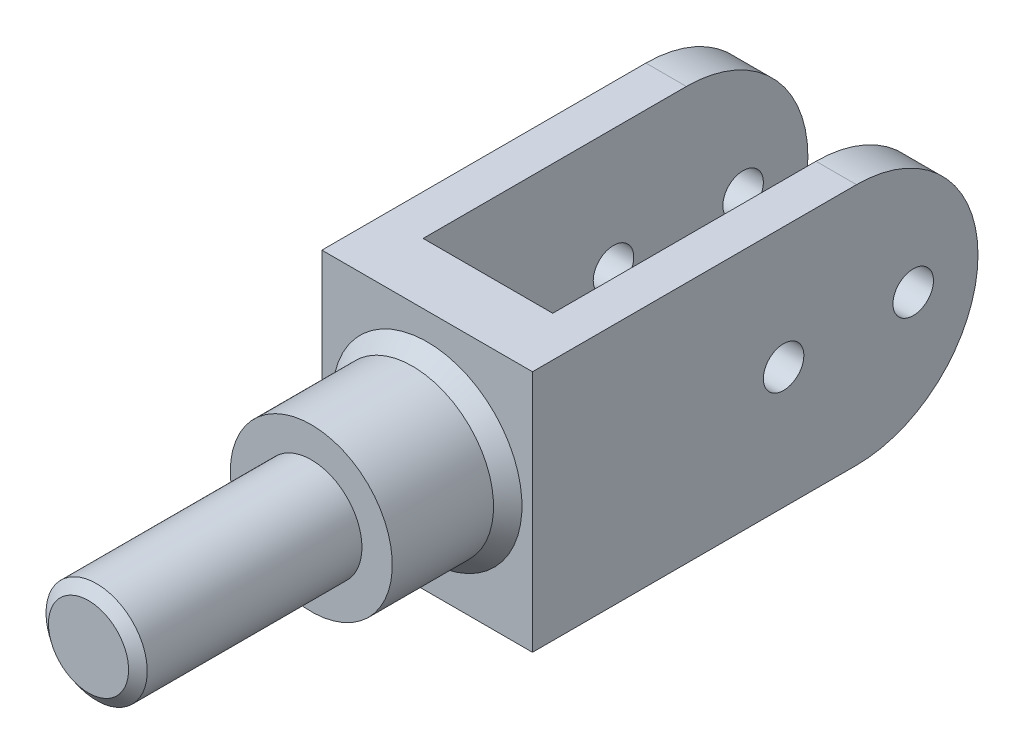
ISO-10303-21;
HEADER;
FILE_DESCRIPTION(('STEP AP214'),'2;1');
FILE_NAME('part.step','',(''),(''),'','','');
FILE_SCHEMA(('AUTOMOTIVE_DESIGN { 1 0 10303 214 1 1 1 1 }'));
ENDSEC;
DATA;
#1=APPLICATION_CONTEXT('core data for automotive mechanical design processes');
#2=APPLICATION_PROTOCOL_DEFINITION('international standard','automotive_design',2000,#1);
#3=PRODUCT_CONTEXT('',#1,'mechanical');
#4=PRODUCT('Part','Part','',(#3));
#5=PRODUCT_RELATED_PRODUCT_CATEGORY('part','',(#4));
#6=PRODUCT_DEFINITION_FORMATION('','',#4);
#7=PRODUCT_DEFINITION_CONTEXT('part definition',#1,'design');
#8=PRODUCT_DEFINITION('design','',#6,#7);
#9=PRODUCT_DEFINITION_SHAPE('','',#8);
#10=(LENGTH_UNIT() NAMED_UNIT(*) SI_UNIT(.MILLI.,.METRE.));
#11=(NAMED_UNIT(*) PLANE_ANGLE_UNIT() SI_UNIT($,.RADIAN.));
#12=(NAMED_UNIT(*) SI_UNIT($,.STERADIAN.) SOLID_ANGLE_UNIT());
#13=UNCERTAINTY_MEASURE_WITH_UNIT(LENGTH_MEASURE(1.E-05),#10,'distance_accuracy_value','');
#14=(GEOMETRIC_REPRESENTATION_CONTEXT(3) GLOBAL_UNCERTAINTY_ASSIGNED_CONTEXT((#13)) GLOBAL_UNIT_ASSIGNED_CONTEXT((#10,
#11,#12)) REPRESENTATION_CONTEXT('',''));
#15=CARTESIAN_POINT('',(0.,0.,0.));
#16=DIRECTION('',(0.,0.,1.));
#17=DIRECTION('',(1.,0.,0.));
#18=AXIS2_PLACEMENT_3D('',#15,#16,#17);
#19=CARTESIAN_POINT('',(-25.9987772316639,-37.678152538923,-19.9658536129877));
#20=DIRECTION('',(-1.,0.,0.));
#21=DIRECTION('',(0.,0.,1.));
#22=AXIS2_PLACEMENT_3D('',#19,#20,#21);
#23=PLANE('',#22);
#24=CARTESIAN_POINT('',(-25.9987772316639,-7.67815253892304,-76.9658536129877));
#25=DIRECTION('',(-1.,0.,0.));
#26=DIRECTION('',(0.,0.,1.));
#27=AXIS2_PLACEMENT_3D('',#24,#25,#26);
#28=CIRCLE('',#27,5.);
#29=CARTESIAN_POINT('',(-25.9987772316639,-7.67815253892304,-71.9658536129877));
#30=VERTEX_POINT('',#29);
#31=EDGE_CURVE('E227',#30,#30,#28,.F.);
#32=ORIENTED_EDGE('',*,*,#31,.T.);
#33=EDGE_LOOP('',(#32));
#34=FACE_BOUND('',#33,.T.);
#35=CARTESIAN_POINT('',(-25.9987772316639,-7.67815253892303,-108.965853612988));
#36=DIRECTION('',(-1.,0.,0.));
#37=DIRECTION('',(0.,0.,1.));
#38=AXIS2_PLACEMENT_3D('',#35,#36,#37);
#39=CIRCLE('',#38,5.);
#40=CARTESIAN_POINT('',(-25.9987772316639,-7.67815253892303,-103.965853612988));
#41=VERTEX_POINT('',#40);
#42=EDGE_CURVE('E210',#41,#41,#39,.F.);
#43=ORIENTED_EDGE('',*,*,#42,.T.);
#44=EDGE_LOOP('',(#43));
#45=FACE_BOUND('',#44,.T.);
#46=CARTESIAN_POINT('',(-25.9987772316639,-7.67815253892303,-94.9658536129877));
#47=DIRECTION('',(-1.,0.,0.));
#48=DIRECTION('',(0.,0.,1.));
#49=AXIS2_PLACEMENT_3D('',#46,#47,#48);
#50=CIRCLE('',#49,30.);
#51=CARTESIAN_POINT('',(-25.9987772316639,-37.678152538923,-94.9658536129877));
#52=VERTEX_POINT('',#51);
#53=CARTESIAN_POINT('',(-25.9987772316639,22.321847461077,-94.9658536129877));
#54=VERTEX_POINT('',#53);
#55=EDGE_CURVE('E148',#52,#54,#50,.F.);
#56=ORIENTED_EDGE('',*,*,#55,.F.);
#57=DIRECTION('',(0.,0.,-1.));
#58=VECTOR('',#57,1.);
#59=CARTESIAN_POINT('',(-25.9987772316639,-37.678152538923,-19.9658536129877));
#60=LINE('',#59,#58);
#61=CARTESIAN_POINT('',(-25.9987772316639,-37.678152538923,-14.9658536129877));
#62=VERTEX_POINT('',#61);
#63=EDGE_CURVE('E165',#62,#52,#60,.T.);
#64=ORIENTED_EDGE('',*,*,#63,.F.);
#65=DIRECTION('',(0.,1.,0.));
#66=VECTOR('',#65,1.);
#67=CARTESIAN_POINT('',(-25.9987772316639,-37.678152538923,-14.9658536129877));
#68=LINE('',#67,#66);
#69=CARTESIAN_POINT('',(-25.9987772316639,22.321847461077,-14.9658536129877));
#70=VERTEX_POINT('',#69);
#71=EDGE_CURVE('E244',#62,#70,#68,.T.);
#72=ORIENTED_EDGE('',*,*,#71,.T.);
#73=DIRECTION('',(0.,0.,-1.));
#74=VECTOR('',#73,1.);
#75=CARTESIAN_POINT('',(-25.9987772316639,22.321847461077,-19.9658536129877));
#76=LINE('',#75,#74);
#77=EDGE_CURVE('E180',#70,#54,#76,.T.);
#78=ORIENTED_EDGE('',*,*,#77,.T.);
#79=EDGE_LOOP('',(#56,#64,#72,#78));
#80=FACE_BOUND('',#79,.T.);
#81=ADVANCED_FACE('F73',(#34,#45,#80),#23,.T.);
#82=CARTESIAN_POINT('',(26.0012227683361,-37.678152538923,-19.9658536129877));
#83=DIRECTION('',(0.,-1.,0.));
#84=DIRECTION('',(1.,0.,0.));
#85=AXIS2_PLACEMENT_3D('',#82,#83,#84);
#86=PLANE('',#85);
#87=ORIENTED_EDGE('',*,*,#63,.T.);
#88=DIRECTION('',(1.,0.,0.));
#89=VECTOR('',#88,1.);
#90=CARTESIAN_POINT('',(-207.998777231664,-37.678152538923,-94.9658536129877));
#91=LINE('',#90,#89);
#92=CARTESIAN_POINT('',(-15.9987772316639,-37.678152538923,-94.9658536129877));
#93=VERTEX_POINT('',#92);
#94=EDGE_CURVE('E158',#52,#93,#91,.T.);
#95=ORIENTED_EDGE('',*,*,#94,.T.);
#96=DIRECTION('',(0.,0.,-1.));
#97=VECTOR('',#96,1.);
#98=CARTESIAN_POINT('',(-15.9987772316639,-37.678152538923,-19.9658536129877));
#99=LINE('',#98,#97);
#100=CARTESIAN_POINT('',(-15.9987772316639,-37.678152538923,-29.9658536129877));
#101=VERTEX_POINT('',#100);
#102=EDGE_CURVE('E198',#101,#93,#99,.T.);
#103=ORIENTED_EDGE('',*,*,#102,.F.);
#104=DIRECTION('',(-1.,0.,0.));
#105=VECTOR('',#104,1.);
#106=CARTESIAN_POINT('',(26.0012227683361,-37.678152538923,-29.9658536129877));
#107=LINE('',#106,#105);
#108=CARTESIAN_POINT('',(16.0012227683361,-37.678152538923,-29.9658536129877));
#109=VERTEX_POINT('',#108);
#110=EDGE_CURVE('E201',#109,#101,#107,.T.);
#111=ORIENTED_EDGE('',*,*,#110,.F.);
#112=DIRECTION('',(0.,0.,1.));
#113=VECTOR('',#112,1.);
#114=CARTESIAN_POINT('',(16.0012227683361,-37.678152538923,-19.9658536129877));
#115=LINE('',#114,#113);
#116=CARTESIAN_POINT('',(16.0012227683361,-37.678152538923,-94.9658536129877));
#117=VERTEX_POINT('',#116);
#118=EDGE_CURVE('E81',#117,#109,#115,.T.);
#119=ORIENTED_EDGE('',*,*,#118,.F.);
#120=CARTESIAN_POINT('',(26.0012227683361,-37.678152538923,-94.9658536129877));
#121=VERTEX_POINT('',#120);
#122=EDGE_CURVE('E141',#117,#121,#91,.T.);
#123=ORIENTED_EDGE('',*,*,#122,.T.);
#124=DIRECTION('',(0.,0.,-1.));
#125=VECTOR('',#124,1.);
#126=CARTESIAN_POINT('',(26.0012227683361,-37.678152538923,-19.9658536129877));
#127=LINE('',#126,#125);
#128=CARTESIAN_POINT('',(26.0012227683361,-37.678152538923,-14.9658536129877));
#129=VERTEX_POINT('',#128);
#130=EDGE_CURVE('E155',#129,#121,#127,.T.);
#131=ORIENTED_EDGE('',*,*,#130,.F.);
#132=DIRECTION('',(-1.,0.,0.));
#133=VECTOR('',#132,1.);
#134=CARTESIAN_POINT('',(26.0012227683361,-37.678152538923,-14.9658536129877));
#135=LINE('',#134,#133);
#136=EDGE_CURVE('E248',#129,#62,#135,.T.);
#137=ORIENTED_EDGE('',*,*,#136,.T.);
#138=EDGE_LOOP('',(#87,#95,#103,#111,#119,#123,#131,#137));
#139=FACE_BOUND('',#138,.T.);
#140=ADVANCED_FACE('F153',(#139),#86,.T.);
#141=CARTESIAN_POINT('',(26.0012227683361,22.321847461077,-19.9658536129877));
#142=DIRECTION('',(1.,0.,0.));
#143=DIRECTION('',(0.,0.,-1.));
#144=AXIS2_PLACEMENT_3D('',#141,#142,#143);
#145=PLANE('',#144);
#146=CARTESIAN_POINT('',(26.0012227683361,-7.67815253892304,-76.9658536129877));
#147=DIRECTION('',(1.,0.,0.));
#148=DIRECTION('',(0.,0.,-1.));
#149=AXIS2_PLACEMENT_3D('',#146,#147,#148);
#150=CIRCLE('',#149,5.);
#151=CARTESIAN_POINT('',(26.0012227683361,-7.67815253892304,-81.9658536129877));
#152=VERTEX_POINT('',#151);
#153=EDGE_CURVE('E214',#152,#152,#150,.F.);
#154=ORIENTED_EDGE('',*,*,#153,.T.);
#155=EDGE_LOOP('',(#154));
#156=FACE_BOUND('',#155,.T.);
#157=CARTESIAN_POINT('',(26.0012227683361,-7.67815253892303,-108.965853612988));
#158=DIRECTION('',(1.,0.,0.));
#159=DIRECTION('',(0.,0.,-1.));
#160=AXIS2_PLACEMENT_3D('',#157,#158,#159);
#161=CIRCLE('',#160,5.);
#162=CARTESIAN_POINT('',(26.0012227683361,-7.67815253892303,-113.965853612988));
#163=VERTEX_POINT('',#162);
#164=EDGE_CURVE('E217',#163,#163,#161,.F.);
#165=ORIENTED_EDGE('',*,*,#164,.T.);
#166=EDGE_LOOP('',(#165));
#167=FACE_BOUND('',#166,.T.);
#168=ORIENTED_EDGE('',*,*,#130,.T.);
#169=CARTESIAN_POINT('',(26.0012227683361,-7.67815253892303,-94.9658536129877));
#170=DIRECTION('',(1.,0.,0.));
#171=DIRECTION('',(0.,0.,-1.));
#172=AXIS2_PLACEMENT_3D('',#169,#170,#171);
#173=CIRCLE('',#172,30.);
#174=CARTESIAN_POINT('',(26.0012227683361,22.321847461077,-94.9658536129877));
#175=VERTEX_POINT('',#174);
#176=EDGE_CURVE('E138',#175,#121,#173,.F.);
#177=ORIENTED_EDGE('',*,*,#176,.F.);
#178=DIRECTION('',(0.,0.,-1.));
#179=VECTOR('',#178,1.);
#180=CARTESIAN_POINT('',(26.0012227683361,22.321847461077,-19.9658536129877));
#181=LINE('',#180,#179);
#182=CARTESIAN_POINT('',(26.0012227683361,22.321847461077,-14.9658536129877));
#183=VERTEX_POINT('',#182);
#184=EDGE_CURVE('E170',#183,#175,#181,.T.);
#185=ORIENTED_EDGE('',*,*,#184,.F.);
#186=DIRECTION('',(0.,-1.,0.));
#187=VECTOR('',#186,1.);
#188=CARTESIAN_POINT('',(26.0012227683361,22.321847461077,-14.9658536129877));
#189=LINE('',#188,#187);
#190=EDGE_CURVE('E162',#183,#129,#189,.T.);
#191=ORIENTED_EDGE('',*,*,#190,.T.);
#192=EDGE_LOOP('',(#168,#177,#185,#191));
#193=FACE_BOUND('',#192,.T.);
#194=ADVANCED_FACE('F160',(#156,#167,#193),#145,.T.);
#195=CARTESIAN_POINT('',(16.0012227683361,-77.678152538923,-29.9658536129877));
#196=DIRECTION('',(1.,0.,0.));
#197=DIRECTION('',(0.,1.,0.));
#198=AXIS2_PLACEMENT_3D('',#195,#196,#197);
#199=PLANE('',#198);
#200=CARTESIAN_POINT('',(16.0012227683361,-7.67815253892303,-108.965853612988));
#201=DIRECTION('',(1.,0.,0.));
#202=DIRECTION('',(0.,1.,0.));
#203=AXIS2_PLACEMENT_3D('',#200,#201,#202);
#204=CIRCLE('',#203,5.);
#205=CARTESIAN_POINT('',(16.0012227683361,-2.67815253892303,-108.965853612988));
#206=VERTEX_POINT('',#205);
#207=EDGE_CURVE('E206',#206,#206,#204,.F.);
#208=ORIENTED_EDGE('',*,*,#207,.F.);
#209=EDGE_LOOP('',(#208));
#210=FACE_BOUND('',#209,.T.);
#211=CARTESIAN_POINT('',(16.0012227683361,-7.67815253892304,-76.9658536129877));
#212=DIRECTION('',(1.,0.,0.));
#213=DIRECTION('',(0.,1.,0.));
#214=AXIS2_PLACEMENT_3D('',#211,#212,#213);
#215=CIRCLE('',#214,5.);
#216=CARTESIAN_POINT('',(16.0012227683361,-2.67815253892303,-76.9658536129877));
#217=VERTEX_POINT('',#216);
#218=EDGE_CURVE('E209',#217,#217,#215,.F.);
#219=ORIENTED_EDGE('',*,*,#218,.F.);
#220=EDGE_LOOP('',(#219));
#221=FACE_BOUND('',#220,.T.);
#222=CARTESIAN_POINT('',(16.0012227683361,-7.67815253892303,-94.9658536129877));
#223=DIRECTION('',(1.,0.,0.));
#224=DIRECTION('',(0.,1.,0.));
#225=AXIS2_PLACEMENT_3D('',#222,#223,#224);
#226=CIRCLE('',#225,30.);
#227=CARTESIAN_POINT('',(16.0012227683361,22.321847461077,-94.9658536129877));
#228=VERTEX_POINT('',#227);
#229=EDGE_CURVE('E149',#228,#117,#226,.F.);
#230=ORIENTED_EDGE('',*,*,#229,.T.);
#231=ORIENTED_EDGE('',*,*,#118,.T.);
#232=DIRECTION('',(0.,1.,0.));
#233=VECTOR('',#232,1.);
#234=CARTESIAN_POINT('',(16.0012227683361,-77.678152538923,-29.9658536129877));
#235=LINE('',#234,#233);
#236=CARTESIAN_POINT('',(16.0012227683361,22.321847461077,-29.9658536129877));
#237=VERTEX_POINT('',#236);
#238=EDGE_CURVE('E238',#109,#237,#235,.T.);
#239=ORIENTED_EDGE('',*,*,#238,.T.);
#240=DIRECTION('',(0.,0.,-1.));
#241=VECTOR('',#240,1.);
#242=CARTESIAN_POINT('',(16.0012227683361,22.321847461077,-29.9658536129877));
#243=LINE('',#242,#241);
#244=EDGE_CURVE('E235',#237,#228,#243,.T.);
#245=ORIENTED_EDGE('',*,*,#244,.T.);
#246=EDGE_LOOP('',(#230,#231,#239,#245));
#247=FACE_BOUND('',#246,.T.);
#248=ADVANCED_FACE('F277',(#210,#221,#247),#199,.F.);
#249=CARTESIAN_POINT('',(-15.9987772316639,-77.678152538923,-124.965853612988));
#250=DIRECTION('',(-1.,0.,0.));
#251=DIRECTION('',(0.,0.,1.));
#252=AXIS2_PLACEMENT_3D('',#249,#250,#251);
#253=PLANE('',#252);
#254=CARTESIAN_POINT('',(-15.9987772316639,-7.67815253892303,-108.965853612988));
#255=DIRECTION('',(-1.,0.,0.));
#256=DIRECTION('',(0.,0.,1.));
#257=AXIS2_PLACEMENT_3D('',#254,#255,#256);
#258=CIRCLE('',#257,5.);
#259=CARTESIAN_POINT('',(-15.9987772316639,-7.67815253892303,-103.965853612988));
#260=VERTEX_POINT('',#259);
#261=EDGE_CURVE('E204',#260,#260,#258,.F.);
#262=ORIENTED_EDGE('',*,*,#261,.F.);
#263=EDGE_LOOP('',(#262));
#264=FACE_BOUND('',#263,.T.);
#265=CARTESIAN_POINT('',(-15.9987772316639,-7.67815253892304,-76.9658536129877));
#266=DIRECTION('',(-1.,0.,0.));
#267=DIRECTION('',(0.,0.,1.));
#268=AXIS2_PLACEMENT_3D('',#265,#266,#267);
#269=CIRCLE('',#268,5.);
#270=CARTESIAN_POINT('',(-15.9987772316639,-7.67815253892304,-71.9658536129877));
#271=VERTEX_POINT('',#270);
#272=EDGE_CURVE('E207',#271,#271,#269,.F.);
#273=ORIENTED_EDGE('',*,*,#272,.F.);
#274=EDGE_LOOP('',(#273));
#275=FACE_BOUND('',#274,.T.);
#276=ORIENTED_EDGE('',*,*,#102,.T.);
#277=CARTESIAN_POINT('',(-15.9987772316639,-7.67815253892303,-94.9658536129877));
#278=DIRECTION('',(-1.,0.,0.));
#279=DIRECTION('',(0.,0.,1.));
#280=AXIS2_PLACEMENT_3D('',#277,#278,#279);
#281=CIRCLE('',#280,30.);
#282=CARTESIAN_POINT('',(-15.9987772316639,22.321847461077,-94.9658536129877));
#283=VERTEX_POINT('',#282);
#284=EDGE_CURVE('E13',#93,#283,#281,.F.);
#285=ORIENTED_EDGE('',*,*,#284,.T.);
#286=DIRECTION('',(0.,0.,1.));
#287=VECTOR('',#286,1.);
#288=CARTESIAN_POINT('',(-15.9987772316639,22.321847461077,-124.965853612988));
#289=LINE('',#288,#287);
#290=CARTESIAN_POINT('',(-15.9987772316639,22.321847461077,-29.9658536129877));
#291=VERTEX_POINT('',#290);
#292=EDGE_CURVE('E230',#283,#291,#289,.T.);
#293=ORIENTED_EDGE('',*,*,#292,.T.);
#294=DIRECTION('',(0.,1.,0.));
#295=VECTOR('',#294,1.);
#296=CARTESIAN_POINT('',(-15.9987772316639,-77.678152538923,-29.9658536129877));
#297=LINE('',#296,#295);
#298=EDGE_CURVE('E95',#101,#291,#297,.T.);
#299=ORIENTED_EDGE('',*,*,#298,.F.);
#300=EDGE_LOOP('',(#276,#285,#293,#299));
#301=FACE_BOUND('',#300,.T.);
#302=ADVANCED_FACE('F280',(#264,#275,#301),#253,.F.);
#303=CARTESIAN_POINT('',(0.,-7.68609771448305,-15.0549543530274));
#304=DIRECTION('',(0.,0.,-1.));
#305=DIRECTION('',(-1.,0.,0.));
#306=AXIS2_PLACEMENT_3D('',#303,#304,#305);
#307=CONICAL_SURFACE('',#306,23.4929032291363,0.756614295865434);
#308=CARTESIAN_POINT('',(0.,-7.68609771448305,-11.3549543530274));
#309=DIRECTION('',(0.,0.,-1.));
#310=DIRECTION('',(-1.,0.,0.));
#311=AXIS2_PLACEMENT_3D('',#308,#309,#310);
#312=CIRCLE('',#311,20.);
#313=CARTESIAN_POINT('',(-20.,-7.68609771448305,-11.3549543530274));
#314=VERTEX_POINT('',#313);
#315=EDGE_CURVE('E168',#314,#314,#312,.T.);
#316=ORIENTED_EDGE('',*,*,#315,.T.);
#317=EDGE_LOOP('',(#316));
#318=FACE_BOUND('',#317,.T.);
#319=CARTESIAN_POINT('',(0.,-7.68609771448305,-14.9658536129878));
#320=DIRECTION('',(0.,0.,-1.));
#321=DIRECTION('',(-1.,0.,0.));
#322=AXIS2_PLACEMENT_3D('',#319,#320,#321);
#323=CIRCLE('',#322,23.408789644649);
#324=CARTESIAN_POINT('',(-23.408789644649,-7.68609771448305,-14.9658536129878));
#325=VERTEX_POINT('',#324);
#326=EDGE_CURVE('E164',#325,#325,#323,.F.);
#327=ORIENTED_EDGE('',*,*,#326,.T.);
#328=EDGE_LOOP('',(#327));
#329=FACE_BOUND('',#328,.T.);
#330=ADVANCED_FACE('F290',(#318,#329),#307,.T.);
#331=CARTESIAN_POINT('',(0.,-7.68609771448305,68.6450456469726));
#332=DIRECTION('',(0.,0.,1.));
#333=DIRECTION('',(1.,0.,0.));
#334=AXIS2_PLACEMENT_3D('',#331,#332,#333);
#335=PLANE('',#334);
#336=CARTESIAN_POINT('',(0.,-7.68609771448305,68.6450456469726));
#337=DIRECTION('',(0.,0.,-1.));
#338=DIRECTION('',(-1.,0.,0.));
#339=AXIS2_PLACEMENT_3D('',#336,#337,#338);
#340=CIRCLE('',#339,9.88910074003972);
#341=CARTESIAN_POINT('',(-9.88910074003972,-7.68609771448305,68.6450456469726));
#342=VERTEX_POINT('',#341);
#343=EDGE_CURVE('E196',#342,#342,#340,.T.);
#344=ORIENTED_EDGE('',*,*,#343,.F.);
#345=EDGE_LOOP('',(#344));
#346=FACE_BOUND('',#345,.T.);
#347=ADVANCED_FACE('F75',(#346),#335,.T.);
#348=CARTESIAN_POINT('',(0.,-7.68609771448305,66.6450456469726));
#349=DIRECTION('',(0.,0.,-1.));
#350=DIRECTION('',(-1.,0.,0.));
#351=AXIS2_PLACEMENT_3D('',#348,#349,#350);
#352=CONICAL_SURFACE('',#351,12.5,0.917121261097702);
#353=ORIENTED_EDGE('',*,*,#343,.T.);
#354=EDGE_LOOP('',(#353));
#355=FACE_BOUND('',#354,.T.);
#356=CARTESIAN_POINT('',(0.,-7.68609771448305,66.6450456469726));
#357=DIRECTION('',(0.,0.,-1.));
#358=DIRECTION('',(-1.,0.,0.));
#359=AXIS2_PLACEMENT_3D('',#356,#357,#358);
#360=CIRCLE('',#359,12.5);
#361=CARTESIAN_POINT('',(-12.5,-7.68609771448305,66.6450456469726));
#362=VERTEX_POINT('',#361);
#363=EDGE_CURVE('E193',#362,#362,#360,.T.);
#364=ORIENTED_EDGE('',*,*,#363,.F.);
#365=EDGE_LOOP('',(#364));
#366=FACE_BOUND('',#365,.T.);
#367=ADVANCED_FACE('F324',(#355,#366),#352,.T.);
#368=CARTESIAN_POINT('',(0.,-7.68609771448305,-15.0549543530274));
#369=DIRECTION('',(0.,0.,-1.));
#370=DIRECTION('',(-1.,0.,0.));
#371=AXIS2_PLACEMENT_3D('',#368,#369,#370);
#372=CYLINDRICAL_SURFACE('',#371,12.5);
#373=ORIENTED_EDGE('',*,*,#363,.T.);
#374=EDGE_LOOP('',(#373));
#375=FACE_BOUND('',#374,.T.);
#376=CARTESIAN_POINT('',(0.,-7.68609771448305,13.6450456469726));
#377=DIRECTION('',(0.,0.,-1.));
#378=DIRECTION('',(-1.,0.,0.));
#379=AXIS2_PLACEMENT_3D('',#376,#377,#378);
#380=CIRCLE('',#379,12.5);
#381=CARTESIAN_POINT('',(-12.5,-7.68609771448305,13.6450456469726));
#382=VERTEX_POINT('',#381);
#383=EDGE_CURVE('E190',#382,#382,#380,.T.);
#384=ORIENTED_EDGE('',*,*,#383,.F.);
#385=EDGE_LOOP('',(#384));
#386=FACE_BOUND('',#385,.T.);
#387=ADVANCED_FACE('F321',(#375,#386),#372,.T.);
#388=CARTESIAN_POINT('',(0.,4.81390228551694,13.6450456469726));
#389=DIRECTION('',(0.,0.,1.));
#390=DIRECTION('',(1.,0.,0.));
#391=AXIS2_PLACEMENT_3D('',#388,#389,#390);
#392=PLANE('',#391);
#393=ORIENTED_EDGE('',*,*,#383,.T.);
#394=EDGE_LOOP('',(#393));
#395=FACE_BOUND('',#394,.T.);
#396=CARTESIAN_POINT('',(0.,-7.68609771448305,13.6450456469726));
#397=DIRECTION('',(0.,0.,-1.));
#398=DIRECTION('',(-1.,0.,0.));
#399=AXIS2_PLACEMENT_3D('',#396,#397,#398);
#400=CIRCLE('',#399,20.);
#401=CARTESIAN_POINT('',(-20.,-7.68609771448305,13.6450456469726));
#402=VERTEX_POINT('',#401);
#403=EDGE_CURVE('E187',#402,#402,#400,.T.);
#404=ORIENTED_EDGE('',*,*,#403,.F.);
#405=EDGE_LOOP('',(#404));
#406=FACE_BOUND('',#405,.T.);
#407=ADVANCED_FACE('F317',(#395,#406),#392,.T.);
#408=CARTESIAN_POINT('',(0.,-7.68609771448305,-15.0549543530274));
#409=DIRECTION('',(0.,0.,-1.));
#410=DIRECTION('',(-1.,0.,0.));
#411=AXIS2_PLACEMENT_3D('',#408,#409,#410);
#412=CYLINDRICAL_SURFACE('',#411,20.);
#413=ORIENTED_EDGE('',*,*,#403,.T.);
#414=EDGE_LOOP('',(#413));
#415=FACE_BOUND('',#414,.T.);
#416=ORIENTED_EDGE('',*,*,#315,.F.);
#417=EDGE_LOOP('',(#416));
#418=FACE_BOUND('',#417,.T.);
#419=ADVANCED_FACE('F314',(#415,#418),#412,.T.);
#420=CARTESIAN_POINT('',(26.0012227683361,22.321847461077,-19.9658536129877));
#421=DIRECTION('',(0.,1.,0.));
#422=DIRECTION('',(-1.,0.,0.));
#423=AXIS2_PLACEMENT_3D('',#420,#421,#422);
#424=PLANE('',#423);
#425=DIRECTION('',(-1.,0.,0.));
#426=VECTOR('',#425,1.);
#427=CARTESIAN_POINT('',(260.001222768336,22.321847461077,-94.9658536129877));
#428=LINE('',#427,#426);
#429=EDGE_CURVE('E88',#283,#54,#428,.T.);
#430=ORIENTED_EDGE('',*,*,#429,.T.);
#431=ORIENTED_EDGE('',*,*,#77,.F.);
#432=DIRECTION('',(1.,0.,0.));
#433=VECTOR('',#432,1.);
#434=CARTESIAN_POINT('',(26.0012227683361,22.321847461077,-14.9658536129877));
#435=LINE('',#434,#433);
#436=EDGE_CURVE('E240',#70,#183,#435,.T.);
#437=ORIENTED_EDGE('',*,*,#436,.T.);
#438=ORIENTED_EDGE('',*,*,#184,.T.);
#439=EDGE_CURVE('E144',#175,#228,#428,.T.);
#440=ORIENTED_EDGE('',*,*,#439,.T.);
#441=ORIENTED_EDGE('',*,*,#244,.F.);
#442=DIRECTION('',(1.,0.,0.));
#443=VECTOR('',#442,1.);
#444=CARTESIAN_POINT('',(-15.9987772316639,22.321847461077,-29.9658536129877));
#445=LINE('',#444,#443);
#446=EDGE_CURVE('E232',#291,#237,#445,.T.);
#447=ORIENTED_EDGE('',*,*,#446,.F.);
#448=ORIENTED_EDGE('',*,*,#292,.F.);
#449=EDGE_LOOP('',(#430,#431,#437,#438,#440,#441,#447,#448));
#450=FACE_BOUND('',#449,.T.);
#451=ADVANCED_FACE('F258',(#450),#424,.T.);
#452=CARTESIAN_POINT('',(0.,0.,-14.9658536129878));
#453=DIRECTION('',(0.,0.,-1.));
#454=DIRECTION('',(-1.,0.,0.));
#455=AXIS2_PLACEMENT_3D('',#452,#453,#454);
#456=PLANE('',#455);
#457=ORIENTED_EDGE('',*,*,#326,.F.);
#458=EDGE_LOOP('',(#457));
#459=FACE_BOUND('',#458,.T.);
#460=ORIENTED_EDGE('',*,*,#436,.F.);
#461=ORIENTED_EDGE('',*,*,#71,.F.);
#462=ORIENTED_EDGE('',*,*,#136,.F.);
#463=ORIENTED_EDGE('',*,*,#190,.F.);
#464=EDGE_LOOP('',(#460,#461,#462,#463));
#465=FACE_BOUND('',#464,.T.);
#466=ADVANCED_FACE('F263',(#459,#465),#456,.F.);
#467=CARTESIAN_POINT('',(-15.9987772316639,-77.678152538923,-29.9658536129877));
#468=DIRECTION('',(0.,0.,1.));
#469=DIRECTION('',(1.,0.,0.));
#470=AXIS2_PLACEMENT_3D('',#467,#468,#469);
#471=PLANE('',#470);
#472=ORIENTED_EDGE('',*,*,#110,.T.);
#473=ORIENTED_EDGE('',*,*,#298,.T.);
#474=ORIENTED_EDGE('',*,*,#446,.T.);
#475=ORIENTED_EDGE('',*,*,#238,.F.);
#476=EDGE_LOOP('',(#472,#473,#474,#475));
#477=FACE_BOUND('',#476,.T.);
#478=ADVANCED_FACE('F288',(#477),#471,.F.);
#479=CARTESIAN_POINT('',(66.0012227683361,-7.67815253892303,-108.965853612988));
#480=DIRECTION('',(-1.,0.,0.));
#481=DIRECTION('',(0.,0.,1.));
#482=AXIS2_PLACEMENT_3D('',#479,#480,#481);
#483=CYLINDRICAL_SURFACE('',#482,5.);
#484=ORIENTED_EDGE('',*,*,#42,.F.);
#485=EDGE_LOOP('',(#484));
#486=FACE_BOUND('',#485,.T.);
#487=ORIENTED_EDGE('',*,*,#261,.T.);
#488=EDGE_LOOP('',(#487));
#489=FACE_BOUND('',#488,.T.);
#490=ADVANCED_FACE('F349',(#486,#489),#483,.F.);
#491=CARTESIAN_POINT('',(66.0012227683361,-7.67815253892304,-76.9658536129877));
#492=DIRECTION('',(-1.,0.,0.));
#493=DIRECTION('',(0.,0.,1.));
#494=AXIS2_PLACEMENT_3D('',#491,#492,#493);
#495=CYLINDRICAL_SURFACE('',#494,5.);
#496=ORIENTED_EDGE('',*,*,#31,.F.);
#497=EDGE_LOOP('',(#496));
#498=FACE_BOUND('',#497,.T.);
#499=ORIENTED_EDGE('',*,*,#272,.T.);
#500=EDGE_LOOP('',(#499));
#501=FACE_BOUND('',#500,.T.);
#502=ADVANCED_FACE('F400',(#498,#501),#495,.F.);
#503=ORIENTED_EDGE('',*,*,#164,.F.);
#504=EDGE_LOOP('',(#503));
#505=FACE_BOUND('',#504,.T.);
#506=ORIENTED_EDGE('',*,*,#207,.T.);
#507=EDGE_LOOP('',(#506));
#508=FACE_BOUND('',#507,.T.);
#509=ADVANCED_FACE('F275',(#505,#508),#483,.F.);
#510=ORIENTED_EDGE('',*,*,#153,.F.);
#511=EDGE_LOOP('',(#510));
#512=FACE_BOUND('',#511,.T.);
#513=ORIENTED_EDGE('',*,*,#218,.T.);
#514=EDGE_LOOP('',(#513));
#515=FACE_BOUND('',#514,.T.);
#516=ADVANCED_FACE('F412',(#512,#515),#495,.F.);
#517=CARTESIAN_POINT('',(260.001222768336,-7.67815253892303,-94.9658536129877));
#518=DIRECTION('',(-1.,0.,0.));
#519=DIRECTION('',(0.,0.,1.));
#520=AXIS2_PLACEMENT_3D('',#517,#518,#519);
#521=CYLINDRICAL_SURFACE('',#520,30.);
#522=ORIENTED_EDGE('',*,*,#55,.T.);
#523=ORIENTED_EDGE('',*,*,#429,.F.);
#524=ORIENTED_EDGE('',*,*,#284,.F.);
#525=ORIENTED_EDGE('',*,*,#94,.F.);
#526=EDGE_LOOP('',(#522,#523,#524,#525));
#527=FACE_BOUND('',#526,.T.);
#528=ADVANCED_FACE('F269',(#527),#521,.T.);
#529=ORIENTED_EDGE('',*,*,#176,.T.);
#530=ORIENTED_EDGE('',*,*,#122,.F.);
#531=ORIENTED_EDGE('',*,*,#229,.F.);
#532=ORIENTED_EDGE('',*,*,#439,.F.);
#533=EDGE_LOOP('',(#529,#530,#531,#532));
#534=FACE_BOUND('',#533,.T.);
#535=ADVANCED_FACE('F140',(#534),#521,.T.);
#536=CLOSED_SHELL('',(#81,#140,#194,#248,#302,#330,#347,#367,#387,#407,#419,#451,#466,#478,#490,
#502,#509,#516,#528,#535));
#537=MANIFOLD_SOLID_BREP('B2',#536);
#538=ADVANCED_BREP_SHAPE_REPRESENTATION('',(#18,#537),#14);
#539=SHAPE_DEFINITION_REPRESENTATION(#9,#538);
ENDSEC;
END-ISO-10303-21;
